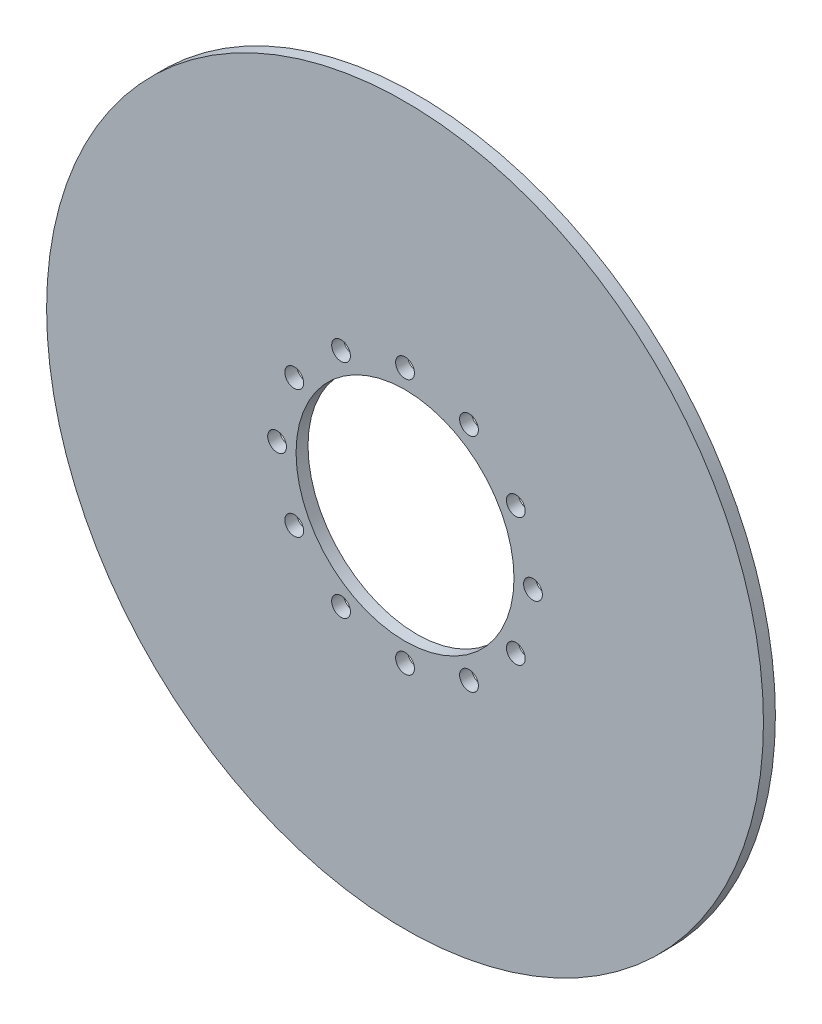
ISO-10303-21;
HEADER;
FILE_DESCRIPTION(('STEP AP214'),'2;1');
FILE_NAME('part.step','',(''),(''),'','','');
FILE_SCHEMA(('AUTOMOTIVE_DESIGN { 1 0 10303 214 1 1 1 1 }'));
ENDSEC;
DATA;
#1=APPLICATION_CONTEXT('core data for automotive mechanical design processes');
#2=APPLICATION_PROTOCOL_DEFINITION('international standard','automotive_design',2000,#1);
#3=PRODUCT_CONTEXT('',#1,'mechanical');
#4=PRODUCT('Part','Part','',(#3));
#5=PRODUCT_RELATED_PRODUCT_CATEGORY('part','',(#4));
#6=PRODUCT_DEFINITION_FORMATION('','',#4);
#7=PRODUCT_DEFINITION_CONTEXT('part definition',#1,'design');
#8=PRODUCT_DEFINITION('design','',#6,#7);
#9=PRODUCT_DEFINITION_SHAPE('','',#8);
#10=(LENGTH_UNIT() NAMED_UNIT(*) SI_UNIT(.MILLI.,.METRE.));
#11=(NAMED_UNIT(*) PLANE_ANGLE_UNIT() SI_UNIT($,.RADIAN.));
#12=(NAMED_UNIT(*) SI_UNIT($,.STERADIAN.) SOLID_ANGLE_UNIT());
#13=UNCERTAINTY_MEASURE_WITH_UNIT(LENGTH_MEASURE(1.E-05),#10,'distance_accuracy_value','');
#14=(GEOMETRIC_REPRESENTATION_CONTEXT(3) GLOBAL_UNCERTAINTY_ASSIGNED_CONTEXT((#13)) GLOBAL_UNIT_ASSIGNED_CONTEXT((#10,
#11,#12)) REPRESENTATION_CONTEXT('',''));
#15=CARTESIAN_POINT('',(0.,0.,0.));
#16=DIRECTION('',(0.,0.,1.));
#17=DIRECTION('',(1.,0.,0.));
#18=AXIS2_PLACEMENT_3D('',#15,#16,#17);
#19=CARTESIAN_POINT('',(0.,0.,3.175));
#20=DIRECTION('',(0.,0.,1.));
#21=DIRECTION('',(1.,0.,0.));
#22=AXIS2_PLACEMENT_3D('',#19,#20,#21);
#23=PLANE('',#22);
#24=CARTESIAN_POINT('',(-29.4448637286702,16.9999999999987,3.175));
#25=DIRECTION('',(0.,0.,1.));
#26=DIRECTION('',(1.,0.,0.));
#27=AXIS2_PLACEMENT_3D('',#24,#25,#26);
#28=CIRCLE('',#27,2.49698906987796);
#29=CARTESIAN_POINT('',(-26.9478746587923,16.9999999999987,3.175));
#30=VERTEX_POINT('',#29);
#31=EDGE_CURVE('E138',#30,#30,#28,.T.);
#32=ORIENTED_EDGE('',*,*,#31,.F.);
#33=EDGE_LOOP('',(#32));
#34=FACE_BOUND('',#33,.T.);
#35=CARTESIAN_POINT('',(-29.4448637286688,-17.0000000000013,3.175));
#36=DIRECTION('',(0.,0.,1.));
#37=DIRECTION('',(1.,0.,0.));
#38=AXIS2_PLACEMENT_3D('',#35,#36,#37);
#39=CIRCLE('',#38,2.49698906987796);
#40=CARTESIAN_POINT('',(-26.9478746587908,-17.0000000000013,3.175));
#41=VERTEX_POINT('',#40);
#42=EDGE_CURVE('E122',#41,#41,#39,.T.);
#43=ORIENTED_EDGE('',*,*,#42,.F.);
#44=EDGE_LOOP('',(#43));
#45=FACE_BOUND('',#44,.T.);
#46=CARTESIAN_POINT('',(2.86804195578331E-12,-34.,3.175));
#47=DIRECTION('',(0.,0.,1.));
#48=DIRECTION('',(1.,0.,0.));
#49=AXIS2_PLACEMENT_3D('',#46,#47,#48);
#50=CIRCLE('',#49,2.49698906987796);
#51=CARTESIAN_POINT('',(2.49698906988083,-34.,3.175));
#52=VERTEX_POINT('',#51);
#53=EDGE_CURVE('E106',#52,#52,#50,.T.);
#54=ORIENTED_EDGE('',*,*,#53,.F.);
#55=EDGE_LOOP('',(#54));
#56=FACE_BOUND('',#55,.T.);
#57=CARTESIAN_POINT('',(29.4448637286731,-16.9999999999988,3.175));
#58=DIRECTION('',(0.,0.,1.));
#59=DIRECTION('',(1.,0.,0.));
#60=AXIS2_PLACEMENT_3D('',#57,#58,#59);
#61=CIRCLE('',#60,2.49698906987769);
#62=CARTESIAN_POINT('',(31.9418527985508,-16.9999999999988,3.175));
#63=VERTEX_POINT('',#62);
#64=EDGE_CURVE('E90',#63,#63,#61,.T.);
#65=ORIENTED_EDGE('',*,*,#64,.F.);
#66=EDGE_LOOP('',(#65));
#67=FACE_BOUND('',#66,.T.);
#68=CARTESIAN_POINT('',(29.4448637286716,17.0000000000012,3.175));
#69=DIRECTION('',(0.,0.,1.));
#70=DIRECTION('',(1.,0.,0.));
#71=AXIS2_PLACEMENT_3D('',#68,#69,#70);
#72=CIRCLE('',#71,2.49698906987796);
#73=CARTESIAN_POINT('',(31.9418527985496,17.0000000000012,3.175));
#74=VERTEX_POINT('',#73);
#75=EDGE_CURVE('E74',#74,#74,#72,.T.);
#76=ORIENTED_EDGE('',*,*,#75,.F.);
#77=EDGE_LOOP('',(#76));
#78=FACE_BOUND('',#77,.T.);
#79=CARTESIAN_POINT('',(0.,34.,3.175));
#80=DIRECTION('',(0.,0.,1.));
#81=DIRECTION('',(1.,0.,0.));
#82=AXIS2_PLACEMENT_3D('',#79,#80,#81);
#83=CIRCLE('',#82,2.49698906987796);
#84=CARTESIAN_POINT('',(2.49698906987796,34.,3.175));
#85=VERTEX_POINT('',#84);
#86=EDGE_CURVE('E58',#85,#85,#83,.T.);
#87=ORIENTED_EDGE('',*,*,#86,.F.);
#88=EDGE_LOOP('',(#87));
#89=FACE_BOUND('',#88,.T.);
#90=CARTESIAN_POINT('',(0.,0.,3.175));
#91=DIRECTION('',(0.,0.,1.));
#92=DIRECTION('',(1.,0.,0.));
#93=AXIS2_PLACEMENT_3D('',#90,#91,#92);
#94=CIRCLE('',#93,95.25);
#95=CARTESIAN_POINT('',(95.25,0.,3.175));
#96=VERTEX_POINT('',#95);
#97=EDGE_CURVE('E10',#96,#96,#94,.T.);
#98=ORIENTED_EDGE('',*,*,#97,.T.);
#99=EDGE_LOOP('',(#98));
#100=FACE_BOUND('',#99,.T.);
#101=CARTESIAN_POINT('',(0.,0.,3.175));
#102=DIRECTION('',(0.,0.,1.));
#103=DIRECTION('',(1.,0.,0.));
#104=AXIS2_PLACEMENT_3D('',#101,#102,#103);
#105=CIRCLE('',#104,28.956);
#106=CARTESIAN_POINT('',(28.956,0.,3.175));
#107=VERTEX_POINT('',#106);
#108=EDGE_CURVE('E52',#107,#107,#105,.T.);
#109=ORIENTED_EDGE('',*,*,#108,.F.);
#110=EDGE_LOOP('',(#109));
#111=FACE_BOUND('',#110,.T.);
#112=CARTESIAN_POINT('',(17.0000000000002,29.4448637286716,3.175));
#113=DIRECTION('',(0.,0.,1.));
#114=DIRECTION('',(1.,0.,0.));
#115=AXIS2_PLACEMENT_3D('',#112,#113,#114);
#116=CIRCLE('',#115,2.49698906987796);
#117=CARTESIAN_POINT('',(19.4969890698782,29.4448637286716,3.175));
#118=VERTEX_POINT('',#117);
#119=EDGE_CURVE('E66',#118,#118,#116,.T.);
#120=ORIENTED_EDGE('',*,*,#119,.F.);
#121=EDGE_LOOP('',(#120));
#122=FACE_BOUND('',#121,.T.);
#123=CARTESIAN_POINT('',(34.0000000000014,1.43402097789165E-12,3.175));
#124=DIRECTION('',(0.,0.,1.));
#125=DIRECTION('',(1.,0.,0.));
#126=AXIS2_PLACEMENT_3D('',#123,#124,#125);
#127=CIRCLE('',#126,2.49698906987796);
#128=CARTESIAN_POINT('',(36.4969890698794,1.43402097789165E-12,3.175));
#129=VERTEX_POINT('',#128);
#130=EDGE_CURVE('E82',#129,#129,#127,.T.);
#131=ORIENTED_EDGE('',*,*,#130,.F.);
#132=EDGE_LOOP('',(#131));
#133=FACE_BOUND('',#132,.T.);
#134=CARTESIAN_POINT('',(17.0000000000027,-29.4448637286702,3.175));
#135=DIRECTION('',(0.,0.,1.));
#136=DIRECTION('',(1.,0.,0.));
#137=AXIS2_PLACEMENT_3D('',#134,#135,#136);
#138=CIRCLE('',#137,2.49698906987837);
#139=CARTESIAN_POINT('',(19.4969890698811,-29.4448637286702,3.175));
#140=VERTEX_POINT('',#139);
#141=EDGE_CURVE('E98',#140,#140,#138,.T.);
#142=ORIENTED_EDGE('',*,*,#141,.F.);
#143=EDGE_LOOP('',(#142));
#144=FACE_BOUND('',#143,.T.);
#145=CARTESIAN_POINT('',(-16.9999999999973,-29.4448637286716,3.175));
#146=DIRECTION('',(0.,0.,1.));
#147=DIRECTION('',(1.,0.,0.));
#148=AXIS2_PLACEMENT_3D('',#145,#146,#147);
#149=CIRCLE('',#148,2.49698906987796);
#150=CARTESIAN_POINT('',(-14.5030109301194,-29.4448637286716,3.175));
#151=VERTEX_POINT('',#150);
#152=EDGE_CURVE('E114',#151,#151,#149,.T.);
#153=ORIENTED_EDGE('',*,*,#152,.F.);
#154=EDGE_LOOP('',(#153));
#155=FACE_BOUND('',#154,.T.);
#156=CARTESIAN_POINT('',(-33.9999999999986,-1.43818477700875E-12,3.175));
#157=DIRECTION('',(0.,0.,1.));
#158=DIRECTION('',(1.,0.,0.));
#159=AXIS2_PLACEMENT_3D('',#156,#157,#158);
#160=CIRCLE('',#159,2.49698906987796);
#161=CARTESIAN_POINT('',(-31.5030109301206,-1.43818477700875E-12,3.175));
#162=VERTEX_POINT('',#161);
#163=EDGE_CURVE('E130',#162,#162,#160,.T.);
#164=ORIENTED_EDGE('',*,*,#163,.F.);
#165=EDGE_LOOP('',(#164));
#166=FACE_BOUND('',#165,.T.);
#167=CARTESIAN_POINT('',(-16.9999999999998,29.4448637286702,3.175));
#168=DIRECTION('',(0.,0.,1.));
#169=DIRECTION('',(1.,0.,0.));
#170=AXIS2_PLACEMENT_3D('',#167,#168,#169);
#171=CIRCLE('',#170,2.49698906987796);
#172=CARTESIAN_POINT('',(-14.5030109301219,29.4448637286702,3.175));
#173=VERTEX_POINT('',#172);
#174=EDGE_CURVE('E146',#173,#173,#171,.T.);
#175=ORIENTED_EDGE('',*,*,#174,.F.);
#176=EDGE_LOOP('',(#175));
#177=FACE_BOUND('',#176,.T.);
#178=ADVANCED_FACE('F39',(#34,#45,#56,#67,#78,#89,#100,#111,#122,#133,#144,#155,#166,#177),#23,.T.);
#179=CARTESIAN_POINT('',(0.,0.,0.));
#180=DIRECTION('',(0.,0.,1.));
#181=DIRECTION('',(1.,0.,0.));
#182=AXIS2_PLACEMENT_3D('',#179,#180,#181);
#183=PLANE('',#182);
#184=CARTESIAN_POINT('',(0.,0.,0.));
#185=DIRECTION('',(0.,0.,1.));
#186=DIRECTION('',(1.,0.,0.));
#187=AXIS2_PLACEMENT_3D('',#184,#185,#186);
#188=CIRCLE('',#187,95.25);
#189=CARTESIAN_POINT('',(95.25,0.,0.));
#190=VERTEX_POINT('',#189);
#191=EDGE_CURVE('E43',#190,#190,#188,.T.);
#192=ORIENTED_EDGE('',*,*,#191,.F.);
#193=EDGE_LOOP('',(#192));
#194=FACE_BOUND('',#193,.T.);
#195=CARTESIAN_POINT('',(0.,0.,0.));
#196=DIRECTION('',(0.,0.,1.));
#197=DIRECTION('',(1.,0.,0.));
#198=AXIS2_PLACEMENT_3D('',#195,#196,#197);
#199=CIRCLE('',#198,28.956);
#200=CARTESIAN_POINT('',(28.956,0.,0.));
#201=VERTEX_POINT('',#200);
#202=EDGE_CURVE('E54',#201,#201,#199,.T.);
#203=ORIENTED_EDGE('',*,*,#202,.T.);
#204=EDGE_LOOP('',(#203));
#205=FACE_BOUND('',#204,.T.);
#206=CARTESIAN_POINT('',(0.,34.,0.));
#207=DIRECTION('',(0.,0.,1.));
#208=DIRECTION('',(1.,0.,0.));
#209=AXIS2_PLACEMENT_3D('',#206,#207,#208);
#210=CIRCLE('',#209,2.49698906987796);
#211=CARTESIAN_POINT('',(2.49698906987796,34.,0.));
#212=VERTEX_POINT('',#211);
#213=EDGE_CURVE('E62',#212,#212,#210,.T.);
#214=ORIENTED_EDGE('',*,*,#213,.T.);
#215=EDGE_LOOP('',(#214));
#216=FACE_BOUND('',#215,.T.);
#217=CARTESIAN_POINT('',(17.0000000000002,29.4448637286716,0.));
#218=DIRECTION('',(0.,0.,1.));
#219=DIRECTION('',(1.,0.,0.));
#220=AXIS2_PLACEMENT_3D('',#217,#218,#219);
#221=CIRCLE('',#220,2.49698906987796);
#222=CARTESIAN_POINT('',(19.4969890698782,29.4448637286716,0.));
#223=VERTEX_POINT('',#222);
#224=EDGE_CURVE('E70',#223,#223,#221,.T.);
#225=ORIENTED_EDGE('',*,*,#224,.T.);
#226=EDGE_LOOP('',(#225));
#227=FACE_BOUND('',#226,.T.);
#228=CARTESIAN_POINT('',(29.4448637286716,17.0000000000012,0.));
#229=DIRECTION('',(0.,0.,1.));
#230=DIRECTION('',(1.,0.,0.));
#231=AXIS2_PLACEMENT_3D('',#228,#229,#230);
#232=CIRCLE('',#231,2.49698906987796);
#233=CARTESIAN_POINT('',(31.9418527985496,17.0000000000012,0.));
#234=VERTEX_POINT('',#233);
#235=EDGE_CURVE('E78',#234,#234,#232,.T.);
#236=ORIENTED_EDGE('',*,*,#235,.T.);
#237=EDGE_LOOP('',(#236));
#238=FACE_BOUND('',#237,.T.);
#239=CARTESIAN_POINT('',(34.0000000000014,1.43402097789165E-12,0.));
#240=DIRECTION('',(0.,0.,1.));
#241=DIRECTION('',(1.,0.,0.));
#242=AXIS2_PLACEMENT_3D('',#239,#240,#241);
#243=CIRCLE('',#242,2.49698906987796);
#244=CARTESIAN_POINT('',(36.4969890698794,1.43402097789165E-12,0.));
#245=VERTEX_POINT('',#244);
#246=EDGE_CURVE('E86',#245,#245,#243,.T.);
#247=ORIENTED_EDGE('',*,*,#246,.T.);
#248=EDGE_LOOP('',(#247));
#249=FACE_BOUND('',#248,.T.);
#250=CARTESIAN_POINT('',(29.4448637286731,-16.9999999999988,0.));
#251=DIRECTION('',(0.,0.,1.));
#252=DIRECTION('',(1.,0.,0.));
#253=AXIS2_PLACEMENT_3D('',#250,#251,#252);
#254=CIRCLE('',#253,2.49698906987769);
#255=CARTESIAN_POINT('',(31.9418527985508,-16.9999999999988,0.));
#256=VERTEX_POINT('',#255);
#257=EDGE_CURVE('E94',#256,#256,#254,.T.);
#258=ORIENTED_EDGE('',*,*,#257,.T.);
#259=EDGE_LOOP('',(#258));
#260=FACE_BOUND('',#259,.T.);
#261=CARTESIAN_POINT('',(17.0000000000027,-29.4448637286702,0.));
#262=DIRECTION('',(0.,0.,1.));
#263=DIRECTION('',(1.,0.,0.));
#264=AXIS2_PLACEMENT_3D('',#261,#262,#263);
#265=CIRCLE('',#264,2.49698906987837);
#266=CARTESIAN_POINT('',(19.4969890698811,-29.4448637286702,0.));
#267=VERTEX_POINT('',#266);
#268=EDGE_CURVE('E102',#267,#267,#265,.T.);
#269=ORIENTED_EDGE('',*,*,#268,.T.);
#270=EDGE_LOOP('',(#269));
#271=FACE_BOUND('',#270,.T.);
#272=CARTESIAN_POINT('',(2.86804195578331E-12,-34.,0.));
#273=DIRECTION('',(0.,0.,1.));
#274=DIRECTION('',(1.,0.,0.));
#275=AXIS2_PLACEMENT_3D('',#272,#273,#274);
#276=CIRCLE('',#275,2.49698906987796);
#277=CARTESIAN_POINT('',(2.49698906988083,-34.,0.));
#278=VERTEX_POINT('',#277);
#279=EDGE_CURVE('E110',#278,#278,#276,.T.);
#280=ORIENTED_EDGE('',*,*,#279,.T.);
#281=EDGE_LOOP('',(#280));
#282=FACE_BOUND('',#281,.T.);
#283=CARTESIAN_POINT('',(-16.9999999999973,-29.4448637286716,0.));
#284=DIRECTION('',(0.,0.,1.));
#285=DIRECTION('',(1.,0.,0.));
#286=AXIS2_PLACEMENT_3D('',#283,#284,#285);
#287=CIRCLE('',#286,2.49698906987796);
#288=CARTESIAN_POINT('',(-14.5030109301194,-29.4448637286716,0.));
#289=VERTEX_POINT('',#288);
#290=EDGE_CURVE('E118',#289,#289,#287,.T.);
#291=ORIENTED_EDGE('',*,*,#290,.T.);
#292=EDGE_LOOP('',(#291));
#293=FACE_BOUND('',#292,.T.);
#294=CARTESIAN_POINT('',(-29.4448637286688,-17.0000000000013,0.));
#295=DIRECTION('',(0.,0.,1.));
#296=DIRECTION('',(1.,0.,0.));
#297=AXIS2_PLACEMENT_3D('',#294,#295,#296);
#298=CIRCLE('',#297,2.49698906987796);
#299=CARTESIAN_POINT('',(-26.9478746587908,-17.0000000000013,0.));
#300=VERTEX_POINT('',#299);
#301=EDGE_CURVE('E126',#300,#300,#298,.T.);
#302=ORIENTED_EDGE('',*,*,#301,.T.);
#303=EDGE_LOOP('',(#302));
#304=FACE_BOUND('',#303,.T.);
#305=CARTESIAN_POINT('',(-33.9999999999986,-1.43818477700875E-12,0.));
#306=DIRECTION('',(0.,0.,1.));
#307=DIRECTION('',(1.,0.,0.));
#308=AXIS2_PLACEMENT_3D('',#305,#306,#307);
#309=CIRCLE('',#308,2.49698906987796);
#310=CARTESIAN_POINT('',(-31.5030109301206,-1.43818477700875E-12,0.));
#311=VERTEX_POINT('',#310);
#312=EDGE_CURVE('E134',#311,#311,#309,.T.);
#313=ORIENTED_EDGE('',*,*,#312,.T.);
#314=EDGE_LOOP('',(#313));
#315=FACE_BOUND('',#314,.T.);
#316=CARTESIAN_POINT('',(-29.4448637286702,16.9999999999987,0.));
#317=DIRECTION('',(0.,0.,1.));
#318=DIRECTION('',(1.,0.,0.));
#319=AXIS2_PLACEMENT_3D('',#316,#317,#318);
#320=CIRCLE('',#319,2.49698906987796);
#321=CARTESIAN_POINT('',(-26.9478746587923,16.9999999999987,0.));
#322=VERTEX_POINT('',#321);
#323=EDGE_CURVE('E142',#322,#322,#320,.T.);
#324=ORIENTED_EDGE('',*,*,#323,.T.);
#325=EDGE_LOOP('',(#324));
#326=FACE_BOUND('',#325,.T.);
#327=CARTESIAN_POINT('',(-16.9999999999998,29.4448637286702,0.));
#328=DIRECTION('',(0.,0.,1.));
#329=DIRECTION('',(1.,0.,0.));
#330=AXIS2_PLACEMENT_3D('',#327,#328,#329);
#331=CIRCLE('',#330,2.49698906987796);
#332=CARTESIAN_POINT('',(-14.5030109301219,29.4448637286702,0.));
#333=VERTEX_POINT('',#332);
#334=EDGE_CURVE('E150',#333,#333,#331,.T.);
#335=ORIENTED_EDGE('',*,*,#334,.T.);
#336=EDGE_LOOP('',(#335));
#337=FACE_BOUND('',#336,.T.);
#338=ADVANCED_FACE('F162',(#194,#205,#216,#227,#238,#249,#260,#271,#282,#293,#304,#315,#326,
#337),#183,.F.);
#339=CARTESIAN_POINT('',(0.,0.,3.175));
#340=DIRECTION('',(0.,0.,-1.));
#341=DIRECTION('',(-1.,0.,0.));
#342=AXIS2_PLACEMENT_3D('',#339,#340,#341);
#343=CYLINDRICAL_SURFACE('',#342,95.25);
#344=ORIENTED_EDGE('',*,*,#97,.F.);
#345=EDGE_LOOP('',(#344));
#346=FACE_BOUND('',#345,.T.);
#347=ORIENTED_EDGE('',*,*,#191,.T.);
#348=EDGE_LOOP('',(#347));
#349=FACE_BOUND('',#348,.T.);
#350=ADVANCED_FACE('F41',(#346,#349),#343,.T.);
#351=CARTESIAN_POINT('',(0.,0.,3.175));
#352=DIRECTION('',(0.,0.,-1.));
#353=DIRECTION('',(-1.,0.,0.));
#354=AXIS2_PLACEMENT_3D('',#351,#352,#353);
#355=CYLINDRICAL_SURFACE('',#354,28.956);
#356=ORIENTED_EDGE('',*,*,#108,.T.);
#357=EDGE_LOOP('',(#356));
#358=FACE_BOUND('',#357,.T.);
#359=ORIENTED_EDGE('',*,*,#202,.F.);
#360=EDGE_LOOP('',(#359));
#361=FACE_BOUND('',#360,.T.);
#362=ADVANCED_FACE('F172',(#358,#361),#355,.F.);
#363=CARTESIAN_POINT('',(0.,34.,3.175));
#364=DIRECTION('',(0.,0.,-1.));
#365=DIRECTION('',(-1.,0.,0.));
#366=AXIS2_PLACEMENT_3D('',#363,#364,#365);
#367=CYLINDRICAL_SURFACE('',#366,2.49698906987796);
#368=ORIENTED_EDGE('',*,*,#86,.T.);
#369=EDGE_LOOP('',(#368));
#370=FACE_BOUND('',#369,.T.);
#371=ORIENTED_EDGE('',*,*,#213,.F.);
#372=EDGE_LOOP('',(#371));
#373=FACE_BOUND('',#372,.T.);
#374=ADVANCED_FACE('F175',(#370,#373),#367,.F.);
#375=CARTESIAN_POINT('',(17.0000000000002,29.4448637286716,3.175));
#376=DIRECTION('',(0.,0.,-1.));
#377=DIRECTION('',(-1.,0.,0.));
#378=AXIS2_PLACEMENT_3D('',#375,#376,#377);
#379=CYLINDRICAL_SURFACE('',#378,2.49698906987796);
#380=ORIENTED_EDGE('',*,*,#119,.T.);
#381=EDGE_LOOP('',(#380));
#382=FACE_BOUND('',#381,.T.);
#383=ORIENTED_EDGE('',*,*,#224,.F.);
#384=EDGE_LOOP('',(#383));
#385=FACE_BOUND('',#384,.T.);
#386=ADVANCED_FACE('F179',(#382,#385),#379,.F.);
#387=CARTESIAN_POINT('',(29.4448637286716,17.0000000000012,3.175));
#388=DIRECTION('',(0.,0.,-1.));
#389=DIRECTION('',(-1.,0.,0.));
#390=AXIS2_PLACEMENT_3D('',#387,#388,#389);
#391=CYLINDRICAL_SURFACE('',#390,2.49698906987796);
#392=ORIENTED_EDGE('',*,*,#75,.T.);
#393=EDGE_LOOP('',(#392));
#394=FACE_BOUND('',#393,.T.);
#395=ORIENTED_EDGE('',*,*,#235,.F.);
#396=EDGE_LOOP('',(#395));
#397=FACE_BOUND('',#396,.T.);
#398=ADVANCED_FACE('F183',(#394,#397),#391,.F.);
#399=CARTESIAN_POINT('',(34.0000000000014,1.43402097789165E-12,3.175));
#400=DIRECTION('',(0.,0.,-1.));
#401=DIRECTION('',(-1.,0.,0.));
#402=AXIS2_PLACEMENT_3D('',#399,#400,#401);
#403=CYLINDRICAL_SURFACE('',#402,2.49698906987796);
#404=ORIENTED_EDGE('',*,*,#130,.T.);
#405=EDGE_LOOP('',(#404));
#406=FACE_BOUND('',#405,.T.);
#407=ORIENTED_EDGE('',*,*,#246,.F.);
#408=EDGE_LOOP('',(#407));
#409=FACE_BOUND('',#408,.T.);
#410=ADVANCED_FACE('F187',(#406,#409),#403,.F.);
#411=CARTESIAN_POINT('',(29.4448637286731,-16.9999999999988,3.175));
#412=DIRECTION('',(0.,0.,-1.));
#413=DIRECTION('',(-1.,0.,0.));
#414=AXIS2_PLACEMENT_3D('',#411,#412,#413);
#415=CYLINDRICAL_SURFACE('',#414,2.49698906987769);
#416=ORIENTED_EDGE('',*,*,#64,.T.);
#417=EDGE_LOOP('',(#416));
#418=FACE_BOUND('',#417,.T.);
#419=ORIENTED_EDGE('',*,*,#257,.F.);
#420=EDGE_LOOP('',(#419));
#421=FACE_BOUND('',#420,.T.);
#422=ADVANCED_FACE('F191',(#418,#421),#415,.F.);
#423=CARTESIAN_POINT('',(17.0000000000027,-29.4448637286702,3.175));
#424=DIRECTION('',(0.,0.,-1.));
#425=DIRECTION('',(-1.,0.,0.));
#426=AXIS2_PLACEMENT_3D('',#423,#424,#425);
#427=CYLINDRICAL_SURFACE('',#426,2.49698906987837);
#428=ORIENTED_EDGE('',*,*,#141,.T.);
#429=EDGE_LOOP('',(#428));
#430=FACE_BOUND('',#429,.T.);
#431=ORIENTED_EDGE('',*,*,#268,.F.);
#432=EDGE_LOOP('',(#431));
#433=FACE_BOUND('',#432,.T.);
#434=ADVANCED_FACE('F195',(#430,#433),#427,.F.);
#435=CARTESIAN_POINT('',(2.86804195578331E-12,-34.,3.175));
#436=DIRECTION('',(0.,0.,-1.));
#437=DIRECTION('',(-1.,0.,0.));
#438=AXIS2_PLACEMENT_3D('',#435,#436,#437);
#439=CYLINDRICAL_SURFACE('',#438,2.49698906987796);
#440=ORIENTED_EDGE('',*,*,#53,.T.);
#441=EDGE_LOOP('',(#440));
#442=FACE_BOUND('',#441,.T.);
#443=ORIENTED_EDGE('',*,*,#279,.F.);
#444=EDGE_LOOP('',(#443));
#445=FACE_BOUND('',#444,.T.);
#446=ADVANCED_FACE('F199',(#442,#445),#439,.F.);
#447=CARTESIAN_POINT('',(-16.9999999999973,-29.4448637286716,3.175));
#448=DIRECTION('',(0.,0.,-1.));
#449=DIRECTION('',(-1.,0.,0.));
#450=AXIS2_PLACEMENT_3D('',#447,#448,#449);
#451=CYLINDRICAL_SURFACE('',#450,2.49698906987796);
#452=ORIENTED_EDGE('',*,*,#152,.T.);
#453=EDGE_LOOP('',(#452));
#454=FACE_BOUND('',#453,.T.);
#455=ORIENTED_EDGE('',*,*,#290,.F.);
#456=EDGE_LOOP('',(#455));
#457=FACE_BOUND('',#456,.T.);
#458=ADVANCED_FACE('F203',(#454,#457),#451,.F.);
#459=CARTESIAN_POINT('',(-29.4448637286688,-17.0000000000013,3.175));
#460=DIRECTION('',(0.,0.,-1.));
#461=DIRECTION('',(-1.,0.,0.));
#462=AXIS2_PLACEMENT_3D('',#459,#460,#461);
#463=CYLINDRICAL_SURFACE('',#462,2.49698906987796);
#464=ORIENTED_EDGE('',*,*,#42,.T.);
#465=EDGE_LOOP('',(#464));
#466=FACE_BOUND('',#465,.T.);
#467=ORIENTED_EDGE('',*,*,#301,.F.);
#468=EDGE_LOOP('',(#467));
#469=FACE_BOUND('',#468,.T.);
#470=ADVANCED_FACE('F207',(#466,#469),#463,.F.);
#471=CARTESIAN_POINT('',(-33.9999999999986,-1.43818477700875E-12,3.175));
#472=DIRECTION('',(0.,0.,-1.));
#473=DIRECTION('',(-1.,0.,0.));
#474=AXIS2_PLACEMENT_3D('',#471,#472,#473);
#475=CYLINDRICAL_SURFACE('',#474,2.49698906987796);
#476=ORIENTED_EDGE('',*,*,#163,.T.);
#477=EDGE_LOOP('',(#476));
#478=FACE_BOUND('',#477,.T.);
#479=ORIENTED_EDGE('',*,*,#312,.F.);
#480=EDGE_LOOP('',(#479));
#481=FACE_BOUND('',#480,.T.);
#482=ADVANCED_FACE('F211',(#478,#481),#475,.F.);
#483=CARTESIAN_POINT('',(-29.4448637286702,16.9999999999987,3.175));
#484=DIRECTION('',(0.,0.,-1.));
#485=DIRECTION('',(-1.,0.,0.));
#486=AXIS2_PLACEMENT_3D('',#483,#484,#485);
#487=CYLINDRICAL_SURFACE('',#486,2.49698906987796);
#488=ORIENTED_EDGE('',*,*,#31,.T.);
#489=EDGE_LOOP('',(#488));
#490=FACE_BOUND('',#489,.T.);
#491=ORIENTED_EDGE('',*,*,#323,.F.);
#492=EDGE_LOOP('',(#491));
#493=FACE_BOUND('',#492,.T.);
#494=ADVANCED_FACE('F215',(#490,#493),#487,.F.);
#495=CARTESIAN_POINT('',(-16.9999999999998,29.4448637286702,3.175));
#496=DIRECTION('',(0.,0.,-1.));
#497=DIRECTION('',(-1.,0.,0.));
#498=AXIS2_PLACEMENT_3D('',#495,#496,#497);
#499=CYLINDRICAL_SURFACE('',#498,2.49698906987796);
#500=ORIENTED_EDGE('',*,*,#174,.T.);
#501=EDGE_LOOP('',(#500));
#502=FACE_BOUND('',#501,.T.);
#503=ORIENTED_EDGE('',*,*,#334,.F.);
#504=EDGE_LOOP('',(#503));
#505=FACE_BOUND('',#504,.T.);
#506=ADVANCED_FACE('F158',(#502,#505),#499,.F.);
#507=CLOSED_SHELL('',(#178,#338,#350,#362,#374,#386,#398,#410,#422,#434,#446,#458,#470,#482,
#494,#506));
#508=MANIFOLD_SOLID_BREP('B2',#507);
#509=ADVANCED_BREP_SHAPE_REPRESENTATION('',(#18,#508),#14);
#510=SHAPE_DEFINITION_REPRESENTATION(#9,#509);
ENDSEC;
END-ISO-10303-21;
